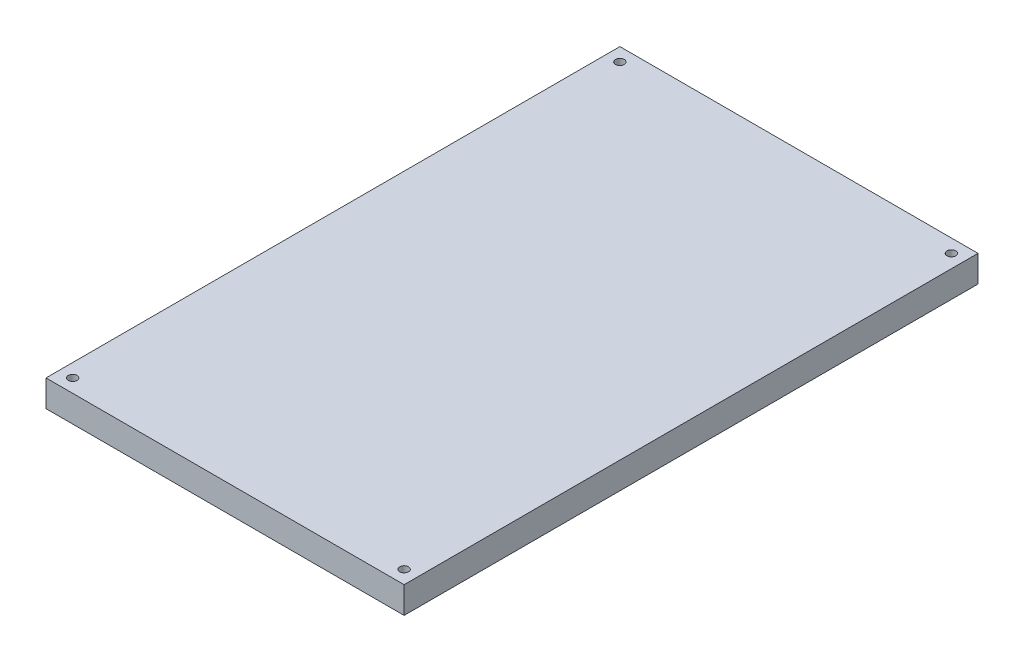
ISO-10303-21;
HEADER;
FILE_DESCRIPTION(('STEP AP214'),'2;1');
FILE_NAME('part.step','',(''),(''),'','','');
FILE_SCHEMA(('AUTOMOTIVE_DESIGN { 1 0 10303 214 1 1 1 1 }'));
ENDSEC;
DATA;
#1=APPLICATION_CONTEXT('core data for automotive mechanical design processes');
#2=APPLICATION_PROTOCOL_DEFINITION('international standard','automotive_design',2000,#1);
#3=PRODUCT_CONTEXT('',#1,'mechanical');
#4=PRODUCT('Part','Part','',(#3));
#5=PRODUCT_RELATED_PRODUCT_CATEGORY('part','',(#4));
#6=PRODUCT_DEFINITION_FORMATION('','',#4);
#7=PRODUCT_DEFINITION_CONTEXT('part definition',#1,'design');
#8=PRODUCT_DEFINITION('design','',#6,#7);
#9=PRODUCT_DEFINITION_SHAPE('','',#8);
#10=(LENGTH_UNIT() NAMED_UNIT(*) SI_UNIT(.MILLI.,.METRE.));
#11=(NAMED_UNIT(*) PLANE_ANGLE_UNIT() SI_UNIT($,.RADIAN.));
#12=(NAMED_UNIT(*) SI_UNIT($,.STERADIAN.) SOLID_ANGLE_UNIT());
#13=UNCERTAINTY_MEASURE_WITH_UNIT(LENGTH_MEASURE(1.E-05),#10,'distance_accuracy_value','');
#14=(GEOMETRIC_REPRESENTATION_CONTEXT(3) GLOBAL_UNCERTAINTY_ASSIGNED_CONTEXT((#13)) GLOBAL_UNIT_ASSIGNED_CONTEXT((#10,
#11,#12)) REPRESENTATION_CONTEXT('',''));
#15=CARTESIAN_POINT('',(0.,0.,0.));
#16=DIRECTION('',(0.,0.,1.));
#17=DIRECTION('',(1.,0.,0.));
#18=AXIS2_PLACEMENT_3D('',#15,#16,#17);
#19=CARTESIAN_POINT('',(-39.,30.800000038,-62.5));
#20=DIRECTION('',(1.,0.,0.));
#21=DIRECTION('',(0.,0.,-1.));
#22=AXIS2_PLACEMENT_3D('',#19,#20,#21);
#23=PLANE('',#22);
#24=DIRECTION('',(0.,0.,1.));
#25=VECTOR('',#24,1.);
#26=CARTESIAN_POINT('',(-39.,25.000000038,-62.5));
#27=LINE('',#26,#25);
#28=CARTESIAN_POINT('',(-39.,25.000000038,-62.5));
#29=VERTEX_POINT('',#28);
#30=CARTESIAN_POINT('',(-39.,25.000000038,62.5));
#31=VERTEX_POINT('',#30);
#32=EDGE_CURVE('E96',#29,#31,#27,.T.);
#33=ORIENTED_EDGE('',*,*,#32,.T.);
#34=DIRECTION('',(0.,-1.,0.));
#35=VECTOR('',#34,1.);
#36=CARTESIAN_POINT('',(-39.,30.800000038,62.5));
#37=LINE('',#36,#35);
#38=CARTESIAN_POINT('',(-39.,30.800000038,62.5));
#39=VERTEX_POINT('',#38);
#40=EDGE_CURVE('E11',#39,#31,#37,.T.);
#41=ORIENTED_EDGE('',*,*,#40,.F.);
#42=DIRECTION('',(0.,0.,1.));
#43=VECTOR('',#42,1.);
#44=CARTESIAN_POINT('',(-39.,30.800000038,-62.5));
#45=LINE('',#44,#43);
#46=CARTESIAN_POINT('',(-39.,30.800000038,-62.5));
#47=VERTEX_POINT('',#46);
#48=EDGE_CURVE('E84',#47,#39,#45,.T.);
#49=ORIENTED_EDGE('',*,*,#48,.F.);
#50=DIRECTION('',(0.,-1.,0.));
#51=VECTOR('',#50,1.);
#52=CARTESIAN_POINT('',(-39.,30.800000038,-62.5));
#53=LINE('',#52,#51);
#54=EDGE_CURVE('E92',#47,#29,#53,.T.);
#55=ORIENTED_EDGE('',*,*,#54,.T.);
#56=EDGE_LOOP('',(#33,#41,#49,#55));
#57=FACE_BOUND('',#56,.T.);
#58=ADVANCED_FACE('F33',(#57),#23,.F.);
#59=CARTESIAN_POINT('',(-39.,30.800000038,62.5));
#60=DIRECTION('',(0.,0.,-1.));
#61=DIRECTION('',(-1.,0.,0.));
#62=AXIS2_PLACEMENT_3D('',#59,#60,#61);
#63=PLANE('',#62);
#64=DIRECTION('',(1.,0.,0.));
#65=VECTOR('',#64,1.);
#66=CARTESIAN_POINT('',(-39.,25.000000038,62.5));
#67=LINE('',#66,#65);
#68=CARTESIAN_POINT('',(39.,25.000000038,62.5));
#69=VERTEX_POINT('',#68);
#70=EDGE_CURVE('E88',#31,#69,#67,.T.);
#71=ORIENTED_EDGE('',*,*,#70,.T.);
#72=DIRECTION('',(0.,-1.,0.));
#73=VECTOR('',#72,1.);
#74=CARTESIAN_POINT('',(39.,30.800000038,62.5));
#75=LINE('',#74,#73);
#76=CARTESIAN_POINT('',(39.,30.800000038,62.5));
#77=VERTEX_POINT('',#76);
#78=EDGE_CURVE('E41',#77,#69,#75,.T.);
#79=ORIENTED_EDGE('',*,*,#78,.F.);
#80=DIRECTION('',(1.,0.,0.));
#81=VECTOR('',#80,1.);
#82=CARTESIAN_POINT('',(-39.,30.800000038,62.5));
#83=LINE('',#82,#81);
#84=EDGE_CURVE('E79',#39,#77,#83,.T.);
#85=ORIENTED_EDGE('',*,*,#84,.F.);
#86=ORIENTED_EDGE('',*,*,#40,.T.);
#87=EDGE_LOOP('',(#71,#79,#85,#86));
#88=FACE_BOUND('',#87,.T.);
#89=ADVANCED_FACE('F87',(#88),#63,.F.);
#90=CARTESIAN_POINT('',(39.,30.800000038,-62.5));
#91=DIRECTION('',(-1.,0.,0.));
#92=DIRECTION('',(0.,0.,1.));
#93=AXIS2_PLACEMENT_3D('',#90,#91,#92);
#94=PLANE('',#93);
#95=DIRECTION('',(0.,0.,-1.));
#96=VECTOR('',#95,1.);
#97=CARTESIAN_POINT('',(39.,25.000000038,-62.5));
#98=LINE('',#97,#96);
#99=CARTESIAN_POINT('',(39.,25.000000038,-62.5));
#100=VERTEX_POINT('',#99);
#101=EDGE_CURVE('E66',#69,#100,#98,.T.);
#102=ORIENTED_EDGE('',*,*,#101,.T.);
#103=DIRECTION('',(0.,-1.,0.));
#104=VECTOR('',#103,1.);
#105=CARTESIAN_POINT('',(39.,30.800000038,-62.5));
#106=LINE('',#105,#104);
#107=CARTESIAN_POINT('',(39.,30.800000038,-62.5));
#108=VERTEX_POINT('',#107);
#109=EDGE_CURVE('E89',#108,#100,#106,.T.);
#110=ORIENTED_EDGE('',*,*,#109,.F.);
#111=DIRECTION('',(0.,0.,-1.));
#112=VECTOR('',#111,1.);
#113=CARTESIAN_POINT('',(39.,30.800000038,-62.5));
#114=LINE('',#113,#112);
#115=EDGE_CURVE('E82',#77,#108,#114,.T.);
#116=ORIENTED_EDGE('',*,*,#115,.F.);
#117=ORIENTED_EDGE('',*,*,#78,.T.);
#118=EDGE_LOOP('',(#102,#110,#116,#117));
#119=FACE_BOUND('',#118,.T.);
#120=ADVANCED_FACE('F90',(#119),#94,.F.);
#121=CARTESIAN_POINT('',(-39.,30.800000038,-62.5));
#122=DIRECTION('',(0.,0.,1.));
#123=DIRECTION('',(1.,0.,0.));
#124=AXIS2_PLACEMENT_3D('',#121,#122,#123);
#125=PLANE('',#124);
#126=DIRECTION('',(-1.,0.,0.));
#127=VECTOR('',#126,1.);
#128=CARTESIAN_POINT('',(-39.,25.000000038,-62.5));
#129=LINE('',#128,#127);
#130=EDGE_CURVE('E72',#100,#29,#129,.T.);
#131=ORIENTED_EDGE('',*,*,#130,.T.);
#132=ORIENTED_EDGE('',*,*,#54,.F.);
#133=DIRECTION('',(-1.,0.,0.));
#134=VECTOR('',#133,1.);
#135=CARTESIAN_POINT('',(-39.,30.800000038,-62.5));
#136=LINE('',#135,#134);
#137=EDGE_CURVE('E49',#108,#47,#136,.T.);
#138=ORIENTED_EDGE('',*,*,#137,.F.);
#139=ORIENTED_EDGE('',*,*,#109,.T.);
#140=EDGE_LOOP('',(#131,#132,#138,#139));
#141=FACE_BOUND('',#140,.T.);
#142=ADVANCED_FACE('F104',(#141),#125,.F.);
#143=CARTESIAN_POINT('',(0.,30.800000038,0.));
#144=DIRECTION('',(0.,1.,0.));
#145=DIRECTION('',(0.,0.,1.));
#146=AXIS2_PLACEMENT_3D('',#143,#144,#145);
#147=PLANE('',#146);
#148=CARTESIAN_POINT('',(36.1,30.800000038,-59.6));
#149=DIRECTION('',(0.,1.,0.));
#150=DIRECTION('',(0.,0.,-1.));
#151=AXIS2_PLACEMENT_3D('',#148,#149,#150);
#152=CIRCLE('',#151,0.954995999999999);
#153=CARTESIAN_POINT('',(36.1,30.800000038,-60.554996));
#154=VERTEX_POINT('',#153);
#155=EDGE_CURVE('E128',#154,#154,#152,.T.);
#156=ORIENTED_EDGE('',*,*,#155,.F.);
#157=EDGE_LOOP('',(#156));
#158=FACE_BOUND('',#157,.T.);
#159=CARTESIAN_POINT('',(-36.1,30.800000038,-59.6));
#160=DIRECTION('',(0.,-1.,0.));
#161=DIRECTION('',(0.,0.,-1.));
#162=AXIS2_PLACEMENT_3D('',#159,#160,#161);
#163=CIRCLE('',#162,0.954995999999999);
#164=CARTESIAN_POINT('',(-36.1,30.800000038,-60.554996));
#165=VERTEX_POINT('',#164);
#166=EDGE_CURVE('E122',#165,#165,#163,.T.);
#167=ORIENTED_EDGE('',*,*,#166,.T.);
#168=EDGE_LOOP('',(#167));
#169=FACE_BOUND('',#168,.T.);
#170=CARTESIAN_POINT('',(36.1,30.800000038,59.6));
#171=DIRECTION('',(0.,-1.,0.));
#172=DIRECTION('',(0.,0.,1.));
#173=AXIS2_PLACEMENT_3D('',#170,#171,#172);
#174=CIRCLE('',#173,0.954995999999999);
#175=CARTESIAN_POINT('',(36.1,30.800000038,60.554996));
#176=VERTEX_POINT('',#175);
#177=EDGE_CURVE('E116',#176,#176,#174,.T.);
#178=ORIENTED_EDGE('',*,*,#177,.T.);
#179=EDGE_LOOP('',(#178));
#180=FACE_BOUND('',#179,.T.);
#181=CARTESIAN_POINT('',(-36.1,30.800000038,59.6));
#182=DIRECTION('',(0.,1.,0.));
#183=DIRECTION('',(0.,0.,1.));
#184=AXIS2_PLACEMENT_3D('',#181,#182,#183);
#185=CIRCLE('',#184,0.954995999999999);
#186=CARTESIAN_POINT('',(-36.1,30.800000038,60.554996));
#187=VERTEX_POINT('',#186);
#188=EDGE_CURVE('E110',#187,#187,#185,.T.);
#189=ORIENTED_EDGE('',*,*,#188,.F.);
#190=EDGE_LOOP('',(#189));
#191=FACE_BOUND('',#190,.T.);
#192=ORIENTED_EDGE('',*,*,#48,.T.);
#193=ORIENTED_EDGE('',*,*,#84,.T.);
#194=ORIENTED_EDGE('',*,*,#115,.T.);
#195=ORIENTED_EDGE('',*,*,#137,.T.);
#196=EDGE_LOOP('',(#192,#193,#194,#195));
#197=FACE_BOUND('',#196,.T.);
#198=ADVANCED_FACE('F80',(#158,#169,#180,#191,#197),#147,.T.);
#199=CARTESIAN_POINT('',(0.,25.000000038,0.));
#200=DIRECTION('',(0.,1.,0.));
#201=DIRECTION('',(0.,0.,1.));
#202=AXIS2_PLACEMENT_3D('',#199,#200,#201);
#203=PLANE('',#202);
#204=CARTESIAN_POINT('',(36.1,25.000000038,-59.6));
#205=DIRECTION('',(0.,1.,0.));
#206=DIRECTION('',(0.,0.,-1.));
#207=AXIS2_PLACEMENT_3D('',#204,#205,#206);
#208=CIRCLE('',#207,0.954995999999999);
#209=CARTESIAN_POINT('',(36.1,25.000000038,-60.554996));
#210=VERTEX_POINT('',#209);
#211=EDGE_CURVE('E125',#210,#210,#208,.T.);
#212=ORIENTED_EDGE('',*,*,#211,.T.);
#213=EDGE_LOOP('',(#212));
#214=FACE_BOUND('',#213,.T.);
#215=CARTESIAN_POINT('',(-36.1,25.000000038,-59.6));
#216=DIRECTION('',(0.,-1.,0.));
#217=DIRECTION('',(0.,0.,-1.));
#218=AXIS2_PLACEMENT_3D('',#215,#216,#217);
#219=CIRCLE('',#218,0.954995999999999);
#220=CARTESIAN_POINT('',(-36.1,25.000000038,-60.554996));
#221=VERTEX_POINT('',#220);
#222=EDGE_CURVE('E119',#221,#221,#219,.T.);
#223=ORIENTED_EDGE('',*,*,#222,.F.);
#224=EDGE_LOOP('',(#223));
#225=FACE_BOUND('',#224,.T.);
#226=CARTESIAN_POINT('',(36.1,25.000000038,59.6));
#227=DIRECTION('',(0.,-1.,0.));
#228=DIRECTION('',(0.,0.,1.));
#229=AXIS2_PLACEMENT_3D('',#226,#227,#228);
#230=CIRCLE('',#229,0.954995999999999);
#231=CARTESIAN_POINT('',(36.1,25.000000038,60.554996));
#232=VERTEX_POINT('',#231);
#233=EDGE_CURVE('E113',#232,#232,#230,.T.);
#234=ORIENTED_EDGE('',*,*,#233,.F.);
#235=EDGE_LOOP('',(#234));
#236=FACE_BOUND('',#235,.T.);
#237=CARTESIAN_POINT('',(-36.1,25.000000038,59.6));
#238=DIRECTION('',(0.,1.,0.));
#239=DIRECTION('',(0.,0.,1.));
#240=AXIS2_PLACEMENT_3D('',#237,#238,#239);
#241=CIRCLE('',#240,0.954995999999999);
#242=CARTESIAN_POINT('',(-36.1,25.000000038,60.554996));
#243=VERTEX_POINT('',#242);
#244=EDGE_CURVE('E99',#243,#243,#241,.T.);
#245=ORIENTED_EDGE('',*,*,#244,.T.);
#246=EDGE_LOOP('',(#245));
#247=FACE_BOUND('',#246,.T.);
#248=ORIENTED_EDGE('',*,*,#32,.F.);
#249=ORIENTED_EDGE('',*,*,#130,.F.);
#250=ORIENTED_EDGE('',*,*,#101,.F.);
#251=ORIENTED_EDGE('',*,*,#70,.F.);
#252=EDGE_LOOP('',(#248,#249,#250,#251));
#253=FACE_BOUND('',#252,.T.);
#254=ADVANCED_FACE('F107',(#214,#225,#236,#247,#253),#203,.F.);
#255=CARTESIAN_POINT('',(-36.1,25.000000038,59.6));
#256=DIRECTION('',(0.,1.,0.));
#257=DIRECTION('',(0.,0.,1.));
#258=AXIS2_PLACEMENT_3D('',#255,#256,#257);
#259=CYLINDRICAL_SURFACE('',#258,0.954995999999999);
#260=ORIENTED_EDGE('',*,*,#244,.F.);
#261=EDGE_LOOP('',(#260));
#262=FACE_BOUND('',#261,.T.);
#263=ORIENTED_EDGE('',*,*,#188,.T.);
#264=EDGE_LOOP('',(#263));
#265=FACE_BOUND('',#264,.T.);
#266=ADVANCED_FACE('F152',(#262,#265),#259,.F.);
#267=CARTESIAN_POINT('',(36.1,25.000000038,59.6));
#268=DIRECTION('',(0.,1.,0.));
#269=DIRECTION('',(0.,0.,1.));
#270=AXIS2_PLACEMENT_3D('',#267,#268,#269);
#271=CYLINDRICAL_SURFACE('',#270,0.954995999999999);
#272=ORIENTED_EDGE('',*,*,#233,.T.);
#273=EDGE_LOOP('',(#272));
#274=FACE_BOUND('',#273,.T.);
#275=ORIENTED_EDGE('',*,*,#177,.F.);
#276=EDGE_LOOP('',(#275));
#277=FACE_BOUND('',#276,.T.);
#278=ADVANCED_FACE('F154',(#274,#277),#271,.F.);
#279=CARTESIAN_POINT('',(-36.1,25.000000038,-59.6));
#280=DIRECTION('',(0.,1.,0.));
#281=DIRECTION('',(0.,0.,1.));
#282=AXIS2_PLACEMENT_3D('',#279,#280,#281);
#283=CYLINDRICAL_SURFACE('',#282,0.954995999999999);
#284=ORIENTED_EDGE('',*,*,#222,.T.);
#285=EDGE_LOOP('',(#284));
#286=FACE_BOUND('',#285,.T.);
#287=ORIENTED_EDGE('',*,*,#166,.F.);
#288=EDGE_LOOP('',(#287));
#289=FACE_BOUND('',#288,.T.);
#290=ADVANCED_FACE('F139',(#286,#289),#283,.F.);
#291=CARTESIAN_POINT('',(36.1,25.000000038,-59.6));
#292=DIRECTION('',(0.,1.,0.));
#293=DIRECTION('',(0.,0.,1.));
#294=AXIS2_PLACEMENT_3D('',#291,#292,#293);
#295=CYLINDRICAL_SURFACE('',#294,0.954995999999999);
#296=ORIENTED_EDGE('',*,*,#211,.F.);
#297=EDGE_LOOP('',(#296));
#298=FACE_BOUND('',#297,.T.);
#299=ORIENTED_EDGE('',*,*,#155,.T.);
#300=EDGE_LOOP('',(#299));
#301=FACE_BOUND('',#300,.T.);
#302=ADVANCED_FACE('F136',(#298,#301),#295,.F.);
#303=CLOSED_SHELL('',(#58,#89,#120,#142,#198,#254,#266,#278,#290,#302));
#304=MANIFOLD_SOLID_BREP('B2',#303);
#305=ADVANCED_BREP_SHAPE_REPRESENTATION('',(#18,#304),#14);
#306=SHAPE_DEFINITION_REPRESENTATION(#9,#305);
ENDSEC;
END-ISO-10303-21;
